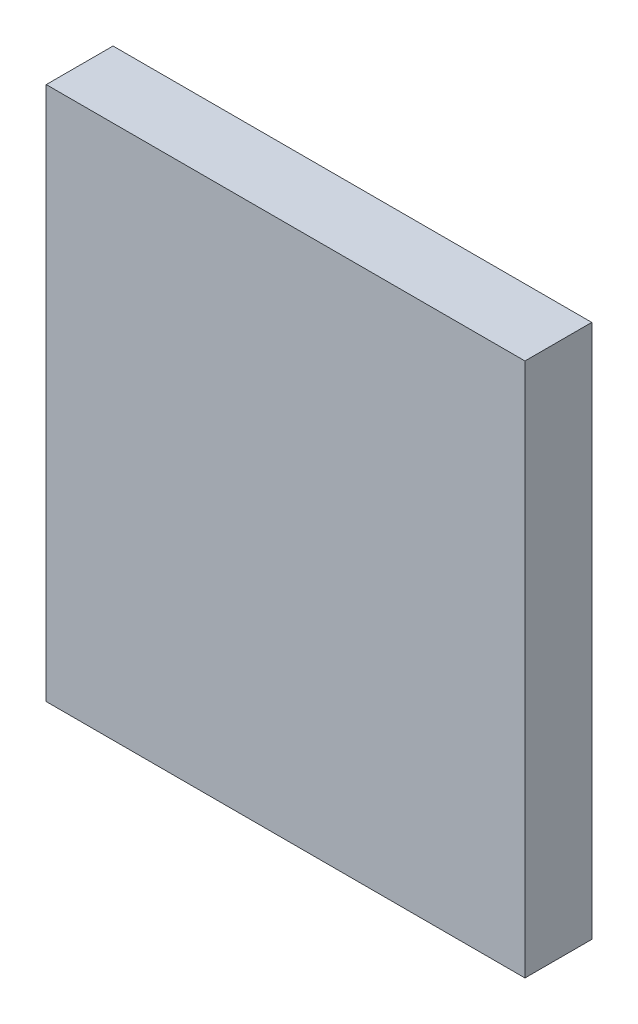
ISO-10303-21;
HEADER;
FILE_DESCRIPTION(('STEP AP214'),'2;1');
FILE_NAME('part.step','',(''),(''),'','','');
FILE_SCHEMA(('AUTOMOTIVE_DESIGN { 1 0 10303 214 1 1 1 1 }'));
ENDSEC;
DATA;
#1=APPLICATION_CONTEXT('core data for automotive mechanical design processes');
#2=APPLICATION_PROTOCOL_DEFINITION('international standard','automotive_design',2000,#1);
#3=PRODUCT_CONTEXT('',#1,'mechanical');
#4=PRODUCT('Part','Part','',(#3));
#5=PRODUCT_RELATED_PRODUCT_CATEGORY('part','',(#4));
#6=PRODUCT_DEFINITION_FORMATION('','',#4);
#7=PRODUCT_DEFINITION_CONTEXT('part definition',#1,'design');
#8=PRODUCT_DEFINITION('design','',#6,#7);
#9=PRODUCT_DEFINITION_SHAPE('','',#8);
#10=(LENGTH_UNIT() NAMED_UNIT(*) SI_UNIT(.MILLI.,.METRE.));
#11=(NAMED_UNIT(*) PLANE_ANGLE_UNIT() SI_UNIT($,.RADIAN.));
#12=(NAMED_UNIT(*) SI_UNIT($,.STERADIAN.) SOLID_ANGLE_UNIT());
#13=UNCERTAINTY_MEASURE_WITH_UNIT(LENGTH_MEASURE(1.E-05),#10,'distance_accuracy_value','');
#14=(GEOMETRIC_REPRESENTATION_CONTEXT(3) GLOBAL_UNCERTAINTY_ASSIGNED_CONTEXT((#13)) GLOBAL_UNIT_ASSIGNED_CONTEXT((#10,
#11,#12)) REPRESENTATION_CONTEXT('',''));
#15=CARTESIAN_POINT('',(0.,0.,0.));
#16=DIRECTION('',(0.,0.,1.));
#17=DIRECTION('',(1.,0.,0.));
#18=AXIS2_PLACEMENT_3D('',#15,#16,#17);
#19=CARTESIAN_POINT('',(-21.5,0.,6.));
#20=DIRECTION('',(1.,0.,0.));
#21=DIRECTION('',(0.,0.,-1.));
#22=AXIS2_PLACEMENT_3D('',#19,#20,#21);
#23=PLANE('',#22);
#24=DIRECTION('',(0.,-1.,0.));
#25=VECTOR('',#24,1.);
#26=CARTESIAN_POINT('',(-21.5,0.,0.));
#27=LINE('',#26,#25);
#28=CARTESIAN_POINT('',(-21.5,48.,0.));
#29=VERTEX_POINT('',#28);
#30=CARTESIAN_POINT('',(-21.5,0.,0.));
#31=VERTEX_POINT('',#30);
#32=EDGE_CURVE('E99',#29,#31,#27,.T.);
#33=ORIENTED_EDGE('',*,*,#32,.T.);
#34=DIRECTION('',(0.,0.,-1.));
#35=VECTOR('',#34,1.);
#36=CARTESIAN_POINT('',(-21.5,0.,6.));
#37=LINE('',#36,#35);
#38=CARTESIAN_POINT('',(-21.5,0.,6.));
#39=VERTEX_POINT('',#38);
#40=EDGE_CURVE('E11',#39,#31,#37,.T.);
#41=ORIENTED_EDGE('',*,*,#40,.F.);
#42=DIRECTION('',(0.,-1.,0.));
#43=VECTOR('',#42,1.);
#44=CARTESIAN_POINT('',(-21.5,0.,6.));
#45=LINE('',#44,#43);
#46=CARTESIAN_POINT('',(-21.5,48.,6.));
#47=VERTEX_POINT('',#46);
#48=EDGE_CURVE('E87',#47,#39,#45,.T.);
#49=ORIENTED_EDGE('',*,*,#48,.F.);
#50=DIRECTION('',(0.,0.,-1.));
#51=VECTOR('',#50,1.);
#52=CARTESIAN_POINT('',(-21.5,48.,6.));
#53=LINE('',#52,#51);
#54=EDGE_CURVE('E95',#47,#29,#53,.T.);
#55=ORIENTED_EDGE('',*,*,#54,.T.);
#56=EDGE_LOOP('',(#33,#41,#49,#55));
#57=FACE_BOUND('',#56,.T.);
#58=ADVANCED_FACE('F36',(#57),#23,.F.);
#59=CARTESIAN_POINT('',(-21.5,0.,6.));
#60=DIRECTION('',(0.,1.,0.));
#61=DIRECTION('',(0.,0.,1.));
#62=AXIS2_PLACEMENT_3D('',#59,#60,#61);
#63=PLANE('',#62);
#64=DIRECTION('',(1.,0.,0.));
#65=VECTOR('',#64,1.);
#66=CARTESIAN_POINT('',(-21.5,0.,0.));
#67=LINE('',#66,#65);
#68=CARTESIAN_POINT('',(21.5,0.,0.));
#69=VERTEX_POINT('',#68);
#70=EDGE_CURVE('E91',#31,#69,#67,.T.);
#71=ORIENTED_EDGE('',*,*,#70,.T.);
#72=DIRECTION('',(0.,0.,-1.));
#73=VECTOR('',#72,1.);
#74=CARTESIAN_POINT('',(21.5,0.,6.));
#75=LINE('',#74,#73);
#76=CARTESIAN_POINT('',(21.5,0.,6.));
#77=VERTEX_POINT('',#76);
#78=EDGE_CURVE('E44',#77,#69,#75,.T.);
#79=ORIENTED_EDGE('',*,*,#78,.F.);
#80=DIRECTION('',(1.,0.,0.));
#81=VECTOR('',#80,1.);
#82=CARTESIAN_POINT('',(-21.5,0.,6.));
#83=LINE('',#82,#81);
#84=EDGE_CURVE('E82',#39,#77,#83,.T.);
#85=ORIENTED_EDGE('',*,*,#84,.F.);
#86=ORIENTED_EDGE('',*,*,#40,.T.);
#87=EDGE_LOOP('',(#71,#79,#85,#86));
#88=FACE_BOUND('',#87,.T.);
#89=ADVANCED_FACE('F90',(#88),#63,.F.);
#90=CARTESIAN_POINT('',(21.5,0.,6.));
#91=DIRECTION('',(-1.,0.,0.));
#92=DIRECTION('',(0.,0.,1.));
#93=AXIS2_PLACEMENT_3D('',#90,#91,#92);
#94=PLANE('',#93);
#95=DIRECTION('',(0.,1.,0.));
#96=VECTOR('',#95,1.);
#97=CARTESIAN_POINT('',(21.5,0.,0.));
#98=LINE('',#97,#96);
#99=CARTESIAN_POINT('',(21.5,48.,0.));
#100=VERTEX_POINT('',#99);
#101=EDGE_CURVE('E69',#69,#100,#98,.T.);
#102=ORIENTED_EDGE('',*,*,#101,.T.);
#103=DIRECTION('',(0.,0.,-1.));
#104=VECTOR('',#103,1.);
#105=CARTESIAN_POINT('',(21.5,48.,6.));
#106=LINE('',#105,#104);
#107=CARTESIAN_POINT('',(21.5,48.,6.));
#108=VERTEX_POINT('',#107);
#109=EDGE_CURVE('E92',#108,#100,#106,.T.);
#110=ORIENTED_EDGE('',*,*,#109,.F.);
#111=DIRECTION('',(0.,1.,0.));
#112=VECTOR('',#111,1.);
#113=CARTESIAN_POINT('',(21.5,0.,6.));
#114=LINE('',#113,#112);
#115=EDGE_CURVE('E85',#77,#108,#114,.T.);
#116=ORIENTED_EDGE('',*,*,#115,.F.);
#117=ORIENTED_EDGE('',*,*,#78,.T.);
#118=EDGE_LOOP('',(#102,#110,#116,#117));
#119=FACE_BOUND('',#118,.T.);
#120=ADVANCED_FACE('F93',(#119),#94,.F.);
#121=CARTESIAN_POINT('',(-21.5,48.,6.));
#122=DIRECTION('',(0.,-1.,0.));
#123=DIRECTION('',(0.,0.,-1.));
#124=AXIS2_PLACEMENT_3D('',#121,#122,#123);
#125=PLANE('',#124);
#126=DIRECTION('',(-1.,0.,0.));
#127=VECTOR('',#126,1.);
#128=CARTESIAN_POINT('',(-21.5,48.,0.));
#129=LINE('',#128,#127);
#130=EDGE_CURVE('E75',#100,#29,#129,.T.);
#131=ORIENTED_EDGE('',*,*,#130,.T.);
#132=ORIENTED_EDGE('',*,*,#54,.F.);
#133=DIRECTION('',(-1.,0.,0.));
#134=VECTOR('',#133,1.);
#135=CARTESIAN_POINT('',(-21.5,48.,6.));
#136=LINE('',#135,#134);
#137=EDGE_CURVE('E52',#108,#47,#136,.T.);
#138=ORIENTED_EDGE('',*,*,#137,.F.);
#139=ORIENTED_EDGE('',*,*,#109,.T.);
#140=EDGE_LOOP('',(#131,#132,#138,#139));
#141=FACE_BOUND('',#140,.T.);
#142=ADVANCED_FACE('F106',(#141),#125,.F.);
#143=CARTESIAN_POINT('',(0.,0.,6.));
#144=DIRECTION('',(0.,0.,-1.));
#145=DIRECTION('',(-1.,0.,0.));
#146=AXIS2_PLACEMENT_3D('',#143,#144,#145);
#147=PLANE('',#146);
#148=ORIENTED_EDGE('',*,*,#48,.T.);
#149=ORIENTED_EDGE('',*,*,#84,.T.);
#150=ORIENTED_EDGE('',*,*,#115,.T.);
#151=ORIENTED_EDGE('',*,*,#137,.T.);
#152=EDGE_LOOP('',(#148,#149,#150,#151));
#153=FACE_BOUND('',#152,.T.);
#154=ADVANCED_FACE('F83',(#153),#147,.F.);
#155=CARTESIAN_POINT('',(0.,0.,0.));
#156=DIRECTION('',(0.,0.,-1.));
#157=DIRECTION('',(-1.,0.,0.));
#158=AXIS2_PLACEMENT_3D('',#155,#156,#157);
#159=PLANE('',#158);
#160=ORIENTED_EDGE('',*,*,#32,.F.);
#161=ORIENTED_EDGE('',*,*,#130,.F.);
#162=ORIENTED_EDGE('',*,*,#101,.F.);
#163=ORIENTED_EDGE('',*,*,#70,.F.);
#164=EDGE_LOOP('',(#160,#161,#162,#163));
#165=FACE_BOUND('',#164,.T.);
#166=ADVANCED_FACE('F109',(#165),#159,.T.);
#167=CLOSED_SHELL('',(#58,#89,#120,#142,#154,#166));
#168=MANIFOLD_SOLID_BREP('B2',#167);
#169=ADVANCED_BREP_SHAPE_REPRESENTATION('',(#18,#168),#14);
#170=SHAPE_DEFINITION_REPRESENTATION(#9,#169);
ENDSEC;
END-ISO-10303-21;
